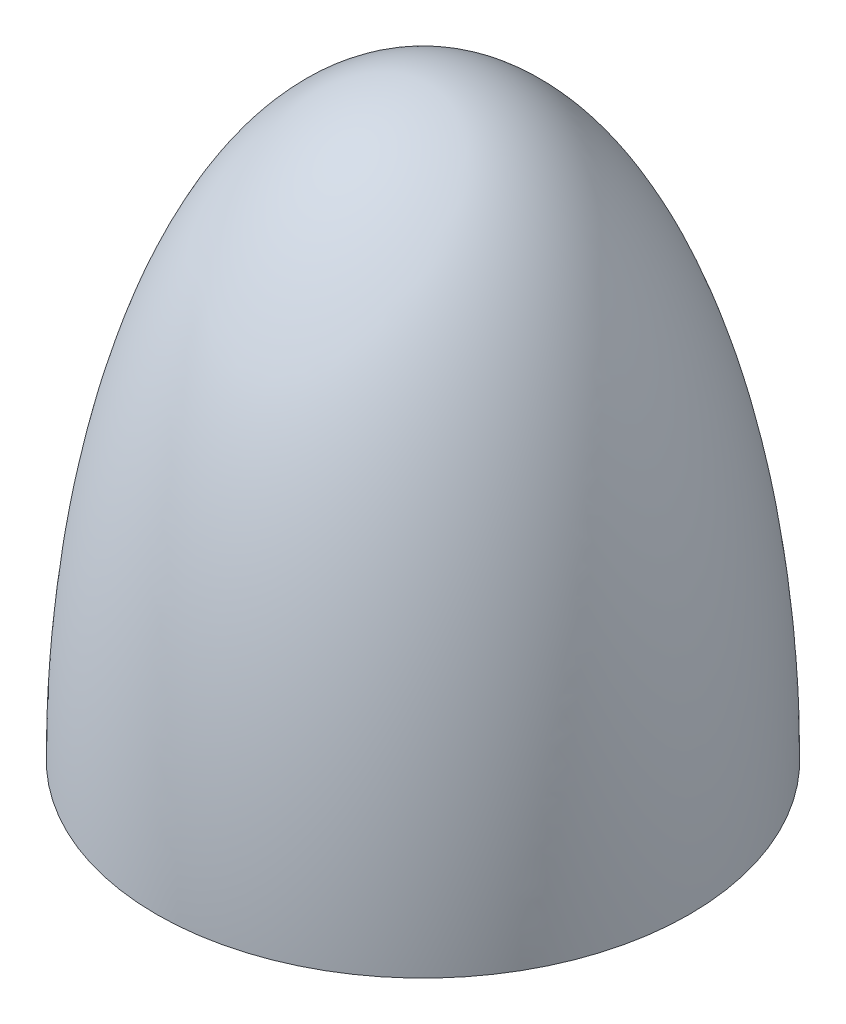
ISO-10303-21;
HEADER;
FILE_DESCRIPTION(('STEP AP214'),'2;1');
FILE_NAME('part.step','',(''),(''),'','','');
FILE_SCHEMA(('AUTOMOTIVE_DESIGN { 1 0 10303 214 1 1 1 1 }'));
ENDSEC;
DATA;
#1=APPLICATION_CONTEXT('core data for automotive mechanical design processes');
#2=APPLICATION_PROTOCOL_DEFINITION('international standard','automotive_design',2000,#1);
#3=PRODUCT_CONTEXT('',#1,'mechanical');
#4=PRODUCT('Part','Part','',(#3));
#5=PRODUCT_RELATED_PRODUCT_CATEGORY('part','',(#4));
#6=PRODUCT_DEFINITION_FORMATION('','',#4);
#7=PRODUCT_DEFINITION_CONTEXT('part definition',#1,'design');
#8=PRODUCT_DEFINITION('design','',#6,#7);
#9=PRODUCT_DEFINITION_SHAPE('','',#8);
#10=(LENGTH_UNIT() NAMED_UNIT(*) SI_UNIT(.MILLI.,.METRE.));
#11=(NAMED_UNIT(*) PLANE_ANGLE_UNIT() SI_UNIT($,.RADIAN.));
#12=(NAMED_UNIT(*) SI_UNIT($,.STERADIAN.) SOLID_ANGLE_UNIT());
#13=UNCERTAINTY_MEASURE_WITH_UNIT(LENGTH_MEASURE(1.E-05),#10,'distance_accuracy_value','');
#14=(GEOMETRIC_REPRESENTATION_CONTEXT(3) GLOBAL_UNCERTAINTY_ASSIGNED_CONTEXT((#13)) GLOBAL_UNIT_ASSIGNED_CONTEXT((#10,
#11,#12)) REPRESENTATION_CONTEXT('',''));
#15=CARTESIAN_POINT('',(0.,0.,0.));
#16=DIRECTION('',(0.,0.,1.));
#17=DIRECTION('',(1.,0.,0.));
#18=AXIS2_PLACEMENT_3D('',#15,#16,#17);
#19=CARTESIAN_POINT('',(0.,0.,0.));
#20=DIRECTION('',(0.,0.,-1.));
#21=DIRECTION('',(0.,1.,0.));
#22=AXIS2_PLACEMENT_3D('',#19,#20,#21);
#23=ELLIPSE('',#22,20.,8.);
#24=TRIMMED_CURVE('',#23,(PARAMETER_VALUE(0.)),(PARAMETER_VALUE(3.14159265358979)),.T.,.PARAMETER.);
#25=CARTESIAN_POINT('',(0.,20.,0.));
#26=DIRECTION('',(0.,-1.,0.));
#27=AXIS1_PLACEMENT('',#25,#26);
#28=SURFACE_OF_REVOLUTION('',#24,#27);
#29=CARTESIAN_POINT('',(0.,0.,0.));
#30=DIRECTION('',(0.,-1.,0.));
#31=DIRECTION('',(0.,0.,-1.));
#32=AXIS2_PLACEMENT_3D('',#29,#30,#31);
#33=CIRCLE('',#32,8.);
#34=CARTESIAN_POINT('',(0.,0.,-8.));
#35=VERTEX_POINT('',#34);
#36=EDGE_CURVE('E11',#35,#35,#33,.T.);
#37=ORIENTED_EDGE('',*,*,#36,.T.);
#38=EDGE_LOOP('',(#37));
#39=FACE_BOUND('',#38,.T.);
#40=CARTESIAN_POINT('',(0.,20.,0.));
#41=VERTEX_POINT('',#40);
#42=VERTEX_LOOP('',#41);
#43=FACE_BOUND('',#42,.T.);
#44=ADVANCED_FACE('F36',(#39,#43),#28,.F.);
#45=CARTESIAN_POINT('',(8.,0.,0.));
#46=DIRECTION('',(0.,-1.,0.));
#47=DIRECTION('',(0.,0.,-1.));
#48=AXIS2_PLACEMENT_3D('',#45,#46,#47);
#49=PLANE('',#48);
#50=CARTESIAN_POINT('',(0.,0.,0.));
#51=DIRECTION('',(0.,-1.,0.));
#52=DIRECTION('',(0.,0.,-1.));
#53=AXIS2_PLACEMENT_3D('',#50,#51,#52);
#54=CIRCLE('',#53,10.);
#55=CARTESIAN_POINT('',(0.,0.,-10.));
#56=VERTEX_POINT('',#55);
#57=EDGE_CURVE('E44',#56,#56,#54,.T.);
#58=ORIENTED_EDGE('',*,*,#57,.T.);
#59=EDGE_LOOP('',(#58));
#60=FACE_BOUND('',#59,.T.);
#61=ORIENTED_EDGE('',*,*,#36,.F.);
#62=EDGE_LOOP('',(#61));
#63=FACE_BOUND('',#62,.T.);
#64=ADVANCED_FACE('F53',(#60,#63),#49,.T.);
#65=CARTESIAN_POINT('',(10.,0.,0.));
#66=CARTESIAN_POINT('',(9.99999999999924,0.680678408258449,0.));
#67=CARTESIAN_POINT('',(9.94652465487736,3.40339204134994,0.));
#68=CARTESIAN_POINT('',(9.41177120367182,8.75459921297821,0.));
#69=CARTESIAN_POINT('',(8.00999431879703,14.0395280334975,0.));
#70=CARTESIAN_POINT('',(6.20992828177802,17.7501234889305,0.));
#71=CARTESIAN_POINT('',(4.56375739894859,19.9723499814914,0.));
#72=CARTESIAN_POINT('',(2.5359389293359,21.5619059688831,0.));
#73=CARTESIAN_POINT('',(0.845312976445299,21.999999999942,0.));
#74=CARTESIAN_POINT('',(0.,21.999999999942,0.));
#75=B_SPLINE_CURVE_WITH_KNOTS('',3,(#65,#66,#67,#68,#69,#70,#71,#72,#73,#74),.UNSPECIFIED.,.F.,
.F.,(4,1,1,1,1,1,1,4),(4.71238898038748,4.81056375080937,5.10508806208341,5.49778714378214,
5.6941366846315,5.89048622548086,6.08683576633022,6.28318530717959),.UNSPECIFIED.);
#76=CARTESIAN_POINT('',(0.,20.,0.));
#77=DIRECTION('',(0.,-1.,0.));
#78=AXIS1_PLACEMENT('',#76,#77);
#79=SURFACE_OF_REVOLUTION('',#75,#78);
#80=CARTESIAN_POINT('',(0.,21.999999999942,0.));
#81=VERTEX_POINT('',#80);
#82=VERTEX_LOOP('',#81);
#83=FACE_BOUND('',#82,.T.);
#84=ORIENTED_EDGE('',*,*,#57,.F.);
#85=EDGE_LOOP('',(#84));
#86=FACE_BOUND('',#85,.T.);
#87=ADVANCED_FACE('F50',(#83,#86),#79,.F.);
#88=CLOSED_SHELL('',(#44,#64,#87));
#89=MANIFOLD_SOLID_BREP('B2',#88);
#90=ADVANCED_BREP_SHAPE_REPRESENTATION('',(#18,#89),#14);
#91=SHAPE_DEFINITION_REPRESENTATION(#9,#90);
ENDSEC;
END-ISO-10303-21;
